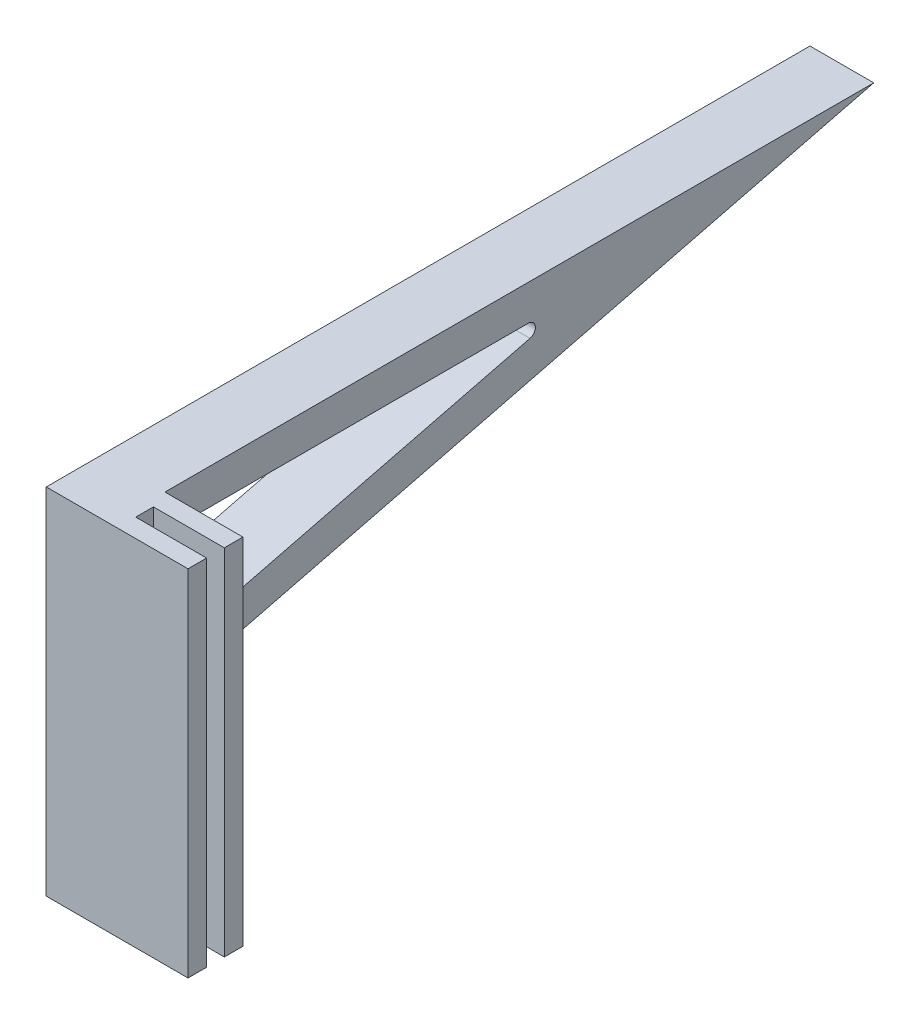
ISO-10303-21;
HEADER;
FILE_DESCRIPTION(('STEP AP214'),'2;1');
FILE_NAME('part.step','',(''),(''),'','','');
FILE_SCHEMA(('AUTOMOTIVE_DESIGN { 1 0 10303 214 1 1 1 1 }'));
ENDSEC;
DATA;
#1=APPLICATION_CONTEXT('core data for automotive mechanical design processes');
#2=APPLICATION_PROTOCOL_DEFINITION('international standard','automotive_design',2000,#1);
#3=PRODUCT_CONTEXT('',#1,'mechanical');
#4=PRODUCT('Part','Part','',(#3));
#5=PRODUCT_RELATED_PRODUCT_CATEGORY('part','',(#4));
#6=PRODUCT_DEFINITION_FORMATION('','',#4);
#7=PRODUCT_DEFINITION_CONTEXT('part definition',#1,'design');
#8=PRODUCT_DEFINITION('design','',#6,#7);
#9=PRODUCT_DEFINITION_SHAPE('','',#8);
#10=(LENGTH_UNIT() NAMED_UNIT(*) SI_UNIT(.MILLI.,.METRE.));
#11=(NAMED_UNIT(*) PLANE_ANGLE_UNIT() SI_UNIT($,.RADIAN.));
#12=(NAMED_UNIT(*) SI_UNIT($,.STERADIAN.) SOLID_ANGLE_UNIT());
#13=UNCERTAINTY_MEASURE_WITH_UNIT(LENGTH_MEASURE(1.E-05),#10,'distance_accuracy_value','');
#14=(GEOMETRIC_REPRESENTATION_CONTEXT(3) GLOBAL_UNCERTAINTY_ASSIGNED_CONTEXT((#13)) GLOBAL_UNIT_ASSIGNED_CONTEXT((#10,
#11,#12)) REPRESENTATION_CONTEXT('',''));
#15=CARTESIAN_POINT('',(0.,0.,0.));
#16=DIRECTION('',(0.,0.,1.));
#17=DIRECTION('',(1.,0.,0.));
#18=AXIS2_PLACEMENT_3D('',#15,#16,#17);
#19=CARTESIAN_POINT('',(20.,100.,-10.25));
#20=DIRECTION('',(0.,0.,1.));
#21=DIRECTION('',(1.,0.,0.));
#22=AXIS2_PLACEMENT_3D('',#19,#20,#21);
#23=PLANE('',#22);
#24=CARTESIAN_POINT('',(9.99999999999545,50.0000000000057,-10.25));
#25=DIRECTION('',(0.,0.,-1.));
#26=DIRECTION('',(-1.,0.,0.));
#27=AXIS2_PLACEMENT_3D('',#24,#25,#26);
#28=CIRCLE('',#27,2.5);
#29=CARTESIAN_POINT('',(7.49999999999545,50.0000000000057,-10.25));
#30=VERTEX_POINT('',#29);
#31=EDGE_CURVE('E324',#30,#30,#28,.T.);
#32=ORIENTED_EDGE('',*,*,#31,.F.);
#33=EDGE_LOOP('',(#32));
#34=FACE_BOUND('',#33,.T.);
#35=DIRECTION('',(0.,-1.,0.));
#36=VECTOR('',#35,1.);
#37=CARTESIAN_POINT('',(-20.,100.,-10.25));
#38=LINE('',#37,#36);
#39=CARTESIAN_POINT('',(-20.,87.,-10.25));
#40=VERTEX_POINT('',#39);
#41=CARTESIAN_POINT('',(-20.,62.869316876853,-10.25));
#42=VERTEX_POINT('',#41);
#43=EDGE_CURVE('E263',#40,#42,#38,.T.);
#44=ORIENTED_EDGE('',*,*,#43,.F.);
#45=DIRECTION('',(-1.,0.,0.));
#46=VECTOR('',#45,1.);
#47=CARTESIAN_POINT('',(-2.,87.,-10.25));
#48=LINE('',#47,#46);
#49=CARTESIAN_POINT('',(-2.00000000000001,87.,-10.25));
#50=VERTEX_POINT('',#49);
#51=EDGE_CURVE('E296',#40,#50,#48,.F.);
#52=ORIENTED_EDGE('',*,*,#51,.T.);
#53=DIRECTION('',(0.,-1.,0.));
#54=VECTOR('',#53,1.);
#55=CARTESIAN_POINT('',(-2.00000000000001,100.,-10.25));
#56=LINE('',#55,#54);
#57=CARTESIAN_POINT('',(-2.,100.,-10.25));
#58=VERTEX_POINT('',#57);
#59=EDGE_CURVE('E214',#58,#50,#56,.T.);
#60=ORIENTED_EDGE('',*,*,#59,.F.);
#61=DIRECTION('',(-1.,0.,0.));
#62=VECTOR('',#61,1.);
#63=CARTESIAN_POINT('',(20.,100.,-10.25));
#64=LINE('',#63,#62);
#65=CARTESIAN_POINT('',(20.,100.,-10.25));
#66=VERTEX_POINT('',#65);
#67=EDGE_CURVE('E191',#66,#58,#64,.T.);
#68=ORIENTED_EDGE('',*,*,#67,.F.);
#69=DIRECTION('',(0.,-1.,0.));
#70=VECTOR('',#69,1.);
#71=CARTESIAN_POINT('',(20.,100.,-10.25));
#72=LINE('',#71,#70);
#73=CARTESIAN_POINT('',(20.,0.,-10.25));
#74=VERTEX_POINT('',#73);
#75=EDGE_CURVE('E264',#66,#74,#72,.T.);
#76=ORIENTED_EDGE('',*,*,#75,.T.);
#77=DIRECTION('',(-1.,0.,0.));
#78=VECTOR('',#77,1.);
#79=CARTESIAN_POINT('',(20.,0.,-10.25));
#80=LINE('',#79,#78);
#81=CARTESIAN_POINT('',(-20.,0.,-10.25));
#82=VERTEX_POINT('',#81);
#83=EDGE_CURVE('E240',#74,#82,#80,.T.);
#84=ORIENTED_EDGE('',*,*,#83,.T.);
#85=CARTESIAN_POINT('',(-20.,47.6576707807868,-10.25));
#86=VERTEX_POINT('',#85);
#87=EDGE_CURVE('E261',#86,#82,#38,.T.);
#88=ORIENTED_EDGE('',*,*,#87,.F.);
#89=DIRECTION('',(-1.,0.,0.));
#90=VECTOR('',#89,1.);
#91=CARTESIAN_POINT('',(20.,47.6576707807868,-10.25));
#92=LINE('',#91,#90);
#93=CARTESIAN_POINT('',(-2.00000000000001,47.6576707807868,-10.25));
#94=VERTEX_POINT('',#93);
#95=EDGE_CURVE('E275',#86,#94,#92,.F.);
#96=ORIENTED_EDGE('',*,*,#95,.T.);
#97=CARTESIAN_POINT('',(-2.00000000000001,62.869316876853,-10.25));
#98=VERTEX_POINT('',#97);
#99=EDGE_CURVE('E203',#98,#94,#56,.T.);
#100=ORIENTED_EDGE('',*,*,#99,.F.);
#101=DIRECTION('',(1.,0.,0.));
#102=VECTOR('',#101,1.);
#103=CARTESIAN_POINT('',(-20.,62.869316876853,-10.25));
#104=LINE('',#103,#102);
#105=EDGE_CURVE('E284',#98,#42,#104,.F.);
#106=ORIENTED_EDGE('',*,*,#105,.T.);
#107=EDGE_LOOP('',(#44,#52,#60,#68,#76,#84,#88,#96,#100,#106));
#108=FACE_BOUND('',#107,.T.);
#109=ADVANCED_FACE('F65',(#34,#108),#23,.F.);
#110=CARTESIAN_POINT('',(0.,100.,0.));
#111=DIRECTION('',(-1.,0.,0.));
#112=DIRECTION('',(0.,0.,1.));
#113=AXIS2_PLACEMENT_3D('',#110,#111,#112);
#114=PLANE('',#113);
#115=DIRECTION('',(0.,0.,-1.));
#116=VECTOR('',#115,1.);
#117=CARTESIAN_POINT('',(0.,0.,0.));
#118=LINE('',#117,#116);
#119=CARTESIAN_POINT('',(0.,0.,0.));
#120=VERTEX_POINT('',#119);
#121=CARTESIAN_POINT('',(0.,0.,-5.));
#122=VERTEX_POINT('',#121);
#123=EDGE_CURVE('E233',#120,#122,#118,.T.);
#124=ORIENTED_EDGE('',*,*,#123,.T.);
#125=DIRECTION('',(0.,-1.,0.));
#126=VECTOR('',#125,1.);
#127=CARTESIAN_POINT('',(0.,100.,-5.));
#128=LINE('',#127,#126);
#129=CARTESIAN_POINT('',(0.,100.,-5.));
#130=VERTEX_POINT('',#129);
#131=EDGE_CURVE('E270',#130,#122,#128,.T.);
#132=ORIENTED_EDGE('',*,*,#131,.F.);
#133=DIRECTION('',(0.,0.,-1.));
#134=VECTOR('',#133,1.);
#135=CARTESIAN_POINT('',(0.,100.,0.));
#136=LINE('',#135,#134);
#137=CARTESIAN_POINT('',(0.,100.,0.));
#138=VERTEX_POINT('',#137);
#139=EDGE_CURVE('E215',#138,#130,#136,.T.);
#140=ORIENTED_EDGE('',*,*,#139,.F.);
#141=DIRECTION('',(0.,-1.,0.));
#142=VECTOR('',#141,1.);
#143=CARTESIAN_POINT('',(0.,100.,0.));
#144=LINE('',#143,#142);
#145=EDGE_CURVE('E232',#138,#120,#144,.T.);
#146=ORIENTED_EDGE('',*,*,#145,.T.);
#147=EDGE_LOOP('',(#124,#132,#140,#146));
#148=FACE_BOUND('',#147,.T.);
#149=ADVANCED_FACE('F336',(#148),#114,.F.);
#150=CARTESIAN_POINT('',(0.,100.,-5.));
#151=DIRECTION('',(0.,0.,-1.));
#152=DIRECTION('',(-1.,0.,0.));
#153=AXIS2_PLACEMENT_3D('',#150,#151,#152);
#154=PLANE('',#153);
#155=CARTESIAN_POINT('',(9.99999999999545,50.0000000000057,-5.));
#156=DIRECTION('',(0.,0.,-1.));
#157=DIRECTION('',(-1.,0.,0.));
#158=AXIS2_PLACEMENT_3D('',#155,#156,#157);
#159=CIRCLE('',#158,2.5);
#160=CARTESIAN_POINT('',(7.49999999999545,50.0000000000057,-5.));
#161=VERTEX_POINT('',#160);
#162=EDGE_CURVE('E320',#161,#161,#159,.F.);
#163=ORIENTED_EDGE('',*,*,#162,.F.);
#164=EDGE_LOOP('',(#163));
#165=FACE_BOUND('',#164,.T.);
#166=DIRECTION('',(1.,0.,0.));
#167=VECTOR('',#166,1.);
#168=CARTESIAN_POINT('',(0.,0.,-5.));
#169=LINE('',#168,#167);
#170=CARTESIAN_POINT('',(20.,0.,-5.));
#171=VERTEX_POINT('',#170);
#172=EDGE_CURVE('E236',#122,#171,#169,.T.);
#173=ORIENTED_EDGE('',*,*,#172,.T.);
#174=DIRECTION('',(0.,-1.,0.));
#175=VECTOR('',#174,1.);
#176=CARTESIAN_POINT('',(20.,100.,-5.));
#177=LINE('',#176,#175);
#178=CARTESIAN_POINT('',(20.,100.,-5.));
#179=VERTEX_POINT('',#178);
#180=EDGE_CURVE('E267',#179,#171,#177,.T.);
#181=ORIENTED_EDGE('',*,*,#180,.F.);
#182=DIRECTION('',(1.,0.,0.));
#183=VECTOR('',#182,1.);
#184=CARTESIAN_POINT('',(0.,100.,-5.));
#185=LINE('',#184,#183);
#186=EDGE_CURVE('E218',#130,#179,#185,.T.);
#187=ORIENTED_EDGE('',*,*,#186,.F.);
#188=ORIENTED_EDGE('',*,*,#131,.T.);
#189=EDGE_LOOP('',(#173,#181,#187,#188));
#190=FACE_BOUND('',#189,.T.);
#191=ADVANCED_FACE('F332',(#165,#190),#154,.F.);
#192=CARTESIAN_POINT('',(20.,100.,-5.));
#193=DIRECTION('',(-1.,0.,0.));
#194=DIRECTION('',(0.,0.,1.));
#195=AXIS2_PLACEMENT_3D('',#192,#193,#194);
#196=PLANE('',#195);
#197=DIRECTION('',(0.,0.,-1.));
#198=VECTOR('',#197,1.);
#199=CARTESIAN_POINT('',(20.,0.,-5.));
#200=LINE('',#199,#198);
#201=EDGE_CURVE('E238',#171,#74,#200,.T.);
#202=ORIENTED_EDGE('',*,*,#201,.T.);
#203=ORIENTED_EDGE('',*,*,#75,.F.);
#204=DIRECTION('',(0.,0.,-1.));
#205=VECTOR('',#204,1.);
#206=CARTESIAN_POINT('',(20.,100.,-5.));
#207=LINE('',#206,#205);
#208=EDGE_CURVE('E221',#179,#66,#207,.T.);
#209=ORIENTED_EDGE('',*,*,#208,.F.);
#210=ORIENTED_EDGE('',*,*,#180,.T.);
#211=EDGE_LOOP('',(#202,#203,#209,#210));
#212=FACE_BOUND('',#211,.T.);
#213=ADVANCED_FACE('F335',(#212),#196,.F.);
#214=CARTESIAN_POINT('',(-20.,100.,5.25000000000001));
#215=DIRECTION('',(1.,0.,0.));
#216=DIRECTION('',(0.,0.,-1.));
#217=AXIS2_PLACEMENT_3D('',#214,#215,#216);
#218=PLANE('',#217);
#219=DIRECTION('',(0.,0.,-1.));
#220=VECTOR('',#219,1.);
#221=CARTESIAN_POINT('',(-20.,90.,-10.25));
#222=LINE('',#221,#220);
#223=CARTESIAN_POINT('',(-20.,90.,-13.25));
#224=VERTEX_POINT('',#223);
#225=CARTESIAN_POINT('',(-20.,90.,-112.772732492588));
#226=VERTEX_POINT('',#225);
#227=EDGE_CURVE('E318',#224,#226,#222,.T.);
#228=ORIENTED_EDGE('',*,*,#227,.F.);
#229=CARTESIAN_POINT('',(-20.,87.,-13.25));
#230=DIRECTION('',(1.,0.,0.));
#231=DIRECTION('',(0.,0.,-1.));
#232=AXIS2_PLACEMENT_3D('',#229,#230,#231);
#233=CIRCLE('',#232,3.);
#234=EDGE_CURVE('E299',#224,#40,#233,.T.);
#235=ORIENTED_EDGE('',*,*,#234,.T.);
#236=ORIENTED_EDGE('',*,*,#43,.T.);
#237=CARTESIAN_POINT('',(-20.,62.869316876853,-12.25));
#238=DIRECTION('',(1.,0.,0.));
#239=DIRECTION('',(0.,0.,-1.));
#240=AXIS2_PLACEMENT_3D('',#237,#238,#239);
#241=CIRCLE('',#240,2.);
#242=CARTESIAN_POINT('',(-20.,60.9290318765623,-12.7350712500726));
#243=VERTEX_POINT('',#242);
#244=EDGE_CURVE('E290',#42,#243,#241,.T.);
#245=ORIENTED_EDGE('',*,*,#244,.T.);
#246=DIRECTION('',(0.,-0.242535625036333,0.970142500145332));
#247=VECTOR('',#246,1.);
#248=CARTESIAN_POINT('',(-20.,109.701425001453,-207.824643749637));
#249=LINE('',#248,#247);
#250=CARTESIAN_POINT('',(-20.,86.0597149997093,-113.257803742661));
#251=VERTEX_POINT('',#250);
#252=EDGE_CURVE('E310',#251,#243,#249,.T.);
#253=ORIENTED_EDGE('',*,*,#252,.F.);
#254=CARTESIAN_POINT('',(-20.,88.,-112.772732492588));
#255=DIRECTION('',(1.,0.,0.));
#256=DIRECTION('',(0.,0.,-1.));
#257=AXIS2_PLACEMENT_3D('',#254,#255,#256);
#258=CIRCLE('',#257,2.);
#259=EDGE_CURVE('E73',#251,#226,#258,.T.);
#260=ORIENTED_EDGE('',*,*,#259,.T.);
#261=EDGE_LOOP('',(#228,#235,#236,#245,#253,#260));
#262=FACE_BOUND('',#261,.T.);
#263=DIRECTION('',(0.,0.,1.));
#264=VECTOR('',#263,1.);
#265=CARTESIAN_POINT('',(-20.,100.,5.25000000000001));
#266=LINE('',#265,#264);
#267=CARTESIAN_POINT('',(-20.,100.,-210.25));
#268=VERTEX_POINT('',#267);
#269=CARTESIAN_POINT('',(-20.,100.,5.25000000000001));
#270=VERTEX_POINT('',#269);
#271=EDGE_CURVE('E224',#268,#270,#266,.T.);
#272=ORIENTED_EDGE('',*,*,#271,.F.);
#273=DIRECTION('',(0.,-0.242535625036333,0.970142500145332));
#274=VECTOR('',#273,1.);
#275=CARTESIAN_POINT('',(-20.,100.,-210.25));
#276=LINE('',#275,#274);
#277=CARTESIAN_POINT('',(-20.,50.5680982812228,-12.522393124891));
#278=VERTEX_POINT('',#277);
#279=EDGE_CURVE('E195',#268,#278,#276,.T.);
#280=ORIENTED_EDGE('',*,*,#279,.T.);
#281=CARTESIAN_POINT('',(-20.,47.6576707807868,-13.25));
#282=DIRECTION('',(1.,0.,0.));
#283=DIRECTION('',(0.,0.,-1.));
#284=AXIS2_PLACEMENT_3D('',#281,#282,#283);
#285=CIRCLE('',#284,3.);
#286=EDGE_CURVE('E278',#278,#86,#285,.T.);
#287=ORIENTED_EDGE('',*,*,#286,.T.);
#288=ORIENTED_EDGE('',*,*,#87,.T.);
#289=DIRECTION('',(0.,0.,1.));
#290=VECTOR('',#289,1.);
#291=CARTESIAN_POINT('',(-20.,0.,5.25000000000001));
#292=LINE('',#291,#290);
#293=CARTESIAN_POINT('',(-20.,0.,5.25000000000001));
#294=VERTEX_POINT('',#293);
#295=EDGE_CURVE('E243',#82,#294,#292,.T.);
#296=ORIENTED_EDGE('',*,*,#295,.T.);
#297=DIRECTION('',(0.,-1.,0.));
#298=VECTOR('',#297,1.);
#299=CARTESIAN_POINT('',(-20.,100.,5.25000000000001));
#300=LINE('',#299,#298);
#301=EDGE_CURVE('E258',#270,#294,#300,.T.);
#302=ORIENTED_EDGE('',*,*,#301,.F.);
#303=EDGE_LOOP('',(#272,#280,#287,#288,#296,#302));
#304=FACE_BOUND('',#303,.T.);
#305=ADVANCED_FACE('F313',(#262,#304),#218,.F.);
#306=CARTESIAN_POINT('',(20.,100.,5.25));
#307=DIRECTION('',(0.,0.,-1.));
#308=DIRECTION('',(-1.,0.,0.));
#309=AXIS2_PLACEMENT_3D('',#306,#307,#308);
#310=PLANE('',#309);
#311=DIRECTION('',(1.,0.,0.));
#312=VECTOR('',#311,1.);
#313=CARTESIAN_POINT('',(20.,0.,5.25));
#314=LINE('',#313,#312);
#315=CARTESIAN_POINT('',(20.,0.,5.25));
#316=VERTEX_POINT('',#315);
#317=EDGE_CURVE('E245',#294,#316,#314,.T.);
#318=ORIENTED_EDGE('',*,*,#317,.T.);
#319=DIRECTION('',(0.,-1.,0.));
#320=VECTOR('',#319,1.);
#321=CARTESIAN_POINT('',(20.,100.,5.25));
#322=LINE('',#321,#320);
#323=CARTESIAN_POINT('',(20.,100.,5.25));
#324=VERTEX_POINT('',#323);
#325=EDGE_CURVE('E255',#324,#316,#322,.T.);
#326=ORIENTED_EDGE('',*,*,#325,.F.);
#327=DIRECTION('',(1.,0.,0.));
#328=VECTOR('',#327,1.);
#329=CARTESIAN_POINT('',(20.,100.,5.25));
#330=LINE('',#329,#328);
#331=EDGE_CURVE('E226',#270,#324,#330,.T.);
#332=ORIENTED_EDGE('',*,*,#331,.F.);
#333=ORIENTED_EDGE('',*,*,#301,.T.);
#334=EDGE_LOOP('',(#318,#326,#332,#333));
#335=FACE_BOUND('',#334,.T.);
#336=ADVANCED_FACE('F409',(#335),#310,.F.);
#337=CARTESIAN_POINT('',(20.,100.,0.));
#338=DIRECTION('',(-1.,0.,0.));
#339=DIRECTION('',(0.,0.,1.));
#340=AXIS2_PLACEMENT_3D('',#337,#338,#339);
#341=PLANE('',#340);
#342=DIRECTION('',(0.,0.,-1.));
#343=VECTOR('',#342,1.);
#344=CARTESIAN_POINT('',(20.,0.,0.));
#345=LINE('',#344,#343);
#346=CARTESIAN_POINT('',(20.,0.,0.));
#347=VERTEX_POINT('',#346);
#348=EDGE_CURVE('E247',#316,#347,#345,.T.);
#349=ORIENTED_EDGE('',*,*,#348,.T.);
#350=DIRECTION('',(0.,-1.,0.));
#351=VECTOR('',#350,1.);
#352=CARTESIAN_POINT('',(20.,100.,0.));
#353=LINE('',#352,#351);
#354=CARTESIAN_POINT('',(20.,100.,0.));
#355=VERTEX_POINT('',#354);
#356=EDGE_CURVE('E252',#355,#347,#353,.T.);
#357=ORIENTED_EDGE('',*,*,#356,.F.);
#358=DIRECTION('',(0.,0.,-1.));
#359=VECTOR('',#358,1.);
#360=CARTESIAN_POINT('',(20.,100.,0.));
#361=LINE('',#360,#359);
#362=EDGE_CURVE('E228',#324,#355,#361,.T.);
#363=ORIENTED_EDGE('',*,*,#362,.F.);
#364=ORIENTED_EDGE('',*,*,#325,.T.);
#365=EDGE_LOOP('',(#349,#357,#363,#364));
#366=FACE_BOUND('',#365,.T.);
#367=ADVANCED_FACE('F474',(#366),#341,.F.);
#368=CARTESIAN_POINT('',(0.,100.,0.));
#369=DIRECTION('',(0.,0.,1.));
#370=DIRECTION('',(1.,0.,0.));
#371=AXIS2_PLACEMENT_3D('',#368,#369,#370);
#372=PLANE('',#371);
#373=DIRECTION('',(-1.,0.,0.));
#374=VECTOR('',#373,1.);
#375=CARTESIAN_POINT('',(0.,0.,0.));
#376=LINE('',#375,#374);
#377=EDGE_CURVE('E219',#347,#120,#376,.T.);
#378=ORIENTED_EDGE('',*,*,#377,.T.);
#379=ORIENTED_EDGE('',*,*,#145,.F.);
#380=DIRECTION('',(-1.,0.,0.));
#381=VECTOR('',#380,1.);
#382=CARTESIAN_POINT('',(0.,100.,0.));
#383=LINE('',#382,#381);
#384=EDGE_CURVE('E230',#355,#138,#383,.T.);
#385=ORIENTED_EDGE('',*,*,#384,.F.);
#386=ORIENTED_EDGE('',*,*,#356,.T.);
#387=EDGE_LOOP('',(#378,#379,#385,#386));
#388=FACE_BOUND('',#387,.T.);
#389=ADVANCED_FACE('F479',(#388),#372,.F.);
#390=CARTESIAN_POINT('',(0.,100.,0.));
#391=DIRECTION('',(0.,-1.,0.));
#392=DIRECTION('',(0.,0.,-1.));
#393=AXIS2_PLACEMENT_3D('',#390,#391,#392);
#394=PLANE('',#393);
#395=ORIENTED_EDGE('',*,*,#331,.T.);
#396=ORIENTED_EDGE('',*,*,#362,.T.);
#397=ORIENTED_EDGE('',*,*,#384,.T.);
#398=ORIENTED_EDGE('',*,*,#139,.T.);
#399=ORIENTED_EDGE('',*,*,#186,.T.);
#400=ORIENTED_EDGE('',*,*,#208,.T.);
#401=ORIENTED_EDGE('',*,*,#67,.T.);
#402=DIRECTION('',(0.,0.,-1.));
#403=VECTOR('',#402,1.);
#404=CARTESIAN_POINT('',(-2.,100.,5.25));
#405=LINE('',#404,#403);
#406=CARTESIAN_POINT('',(-2.00000000000005,100.,-210.25));
#407=VERTEX_POINT('',#406);
#408=EDGE_CURVE('E185',#58,#407,#405,.T.);
#409=ORIENTED_EDGE('',*,*,#408,.T.);
#410=DIRECTION('',(-1.,0.,0.));
#411=VECTOR('',#410,1.);
#412=CARTESIAN_POINT('',(-2.00000000000005,100.,-210.25));
#413=LINE('',#412,#411);
#414=EDGE_CURVE('E188',#407,#268,#413,.T.);
#415=ORIENTED_EDGE('',*,*,#414,.T.);
#416=ORIENTED_EDGE('',*,*,#271,.T.);
#417=EDGE_LOOP('',(#395,#396,#397,#398,#399,#400,#401,#409,#415,#416));
#418=FACE_BOUND('',#417,.T.);
#419=ADVANCED_FACE('F187',(#418),#394,.F.);
#420=CARTESIAN_POINT('',(0.,0.,0.));
#421=DIRECTION('',(0.,-1.,0.));
#422=DIRECTION('',(0.,0.,-1.));
#423=AXIS2_PLACEMENT_3D('',#420,#421,#422);
#424=PLANE('',#423);
#425=ORIENTED_EDGE('',*,*,#295,.F.);
#426=ORIENTED_EDGE('',*,*,#83,.F.);
#427=ORIENTED_EDGE('',*,*,#201,.F.);
#428=ORIENTED_EDGE('',*,*,#172,.F.);
#429=ORIENTED_EDGE('',*,*,#123,.F.);
#430=ORIENTED_EDGE('',*,*,#377,.F.);
#431=ORIENTED_EDGE('',*,*,#348,.F.);
#432=ORIENTED_EDGE('',*,*,#317,.F.);
#433=EDGE_LOOP('',(#425,#426,#427,#428,#429,#430,#431,#432));
#434=FACE_BOUND('',#433,.T.);
#435=ADVANCED_FACE('F348',(#434),#424,.T.);
#436=CARTESIAN_POINT('',(-2.00000000000005,109.701425001453,-207.824643749637));
#437=DIRECTION('',(0.,-0.970142500145332,-0.242535625036333));
#438=DIRECTION('',(0.,0.242535625036333,-0.970142500145332));
#439=AXIS2_PLACEMENT_3D('',#436,#437,#438);
#440=PLANE('',#439);
#441=DIRECTION('',(0.,-0.242535625036333,0.970142500145332));
#442=VECTOR('',#441,1.);
#443=CARTESIAN_POINT('',(-2.00000000000005,109.701425001453,-207.824643749637));
#444=LINE('',#443,#442);
#445=CARTESIAN_POINT('',(-2.00000000000003,86.0597149997093,-113.257803742661));
#446=VERTEX_POINT('',#445);
#447=CARTESIAN_POINT('',(-2.00000000000001,60.9290318765623,-12.7350712500726));
#448=VERTEX_POINT('',#447);
#449=EDGE_CURVE('E211',#446,#448,#444,.T.);
#450=ORIENTED_EDGE('',*,*,#449,.F.);
#451=DIRECTION('',(-1.,0.,0.));
#452=VECTOR('',#451,1.);
#453=CARTESIAN_POINT('',(-20.,86.0597149997093,-113.257803742661));
#454=LINE('',#453,#452);
#455=EDGE_CURVE('E303',#446,#251,#454,.T.);
#456=ORIENTED_EDGE('',*,*,#455,.T.);
#457=ORIENTED_EDGE('',*,*,#252,.T.);
#458=DIRECTION('',(1.,0.,0.));
#459=VECTOR('',#458,1.);
#460=CARTESIAN_POINT('',(-2.00000000000001,60.9290318765623,-12.7350712500727));
#461=LINE('',#460,#459);
#462=EDGE_CURVE('E281',#243,#448,#461,.T.);
#463=ORIENTED_EDGE('',*,*,#462,.T.);
#464=EDGE_LOOP('',(#450,#456,#457,#463));
#465=FACE_BOUND('',#464,.T.);
#466=ADVANCED_FACE('F309',(#465),#440,.F.);
#467=CARTESIAN_POINT('',(-2.00000000000001,90.,-10.25));
#468=DIRECTION('',(0.,1.,0.));
#469=DIRECTION('',(0.,0.,1.));
#470=AXIS2_PLACEMENT_3D('',#467,#468,#469);
#471=PLANE('',#470);
#472=ORIENTED_EDGE('',*,*,#227,.T.);
#473=DIRECTION('',(-1.,0.,0.));
#474=VECTOR('',#473,1.);
#475=CARTESIAN_POINT('',(-2.00000000000003,90.,-112.772732492588));
#476=LINE('',#475,#474);
#477=CARTESIAN_POINT('',(-2.00000000000003,90.,-112.772732492588));
#478=VERTEX_POINT('',#477);
#479=EDGE_CURVE('E86',#226,#478,#476,.F.);
#480=ORIENTED_EDGE('',*,*,#479,.T.);
#481=DIRECTION('',(0.,0.,-1.));
#482=VECTOR('',#481,1.);
#483=CARTESIAN_POINT('',(-2.,90.,5.25));
#484=LINE('',#483,#482);
#485=CARTESIAN_POINT('',(-2.00000000000001,90.,-13.25));
#486=VERTEX_POINT('',#485);
#487=EDGE_CURVE('E317',#486,#478,#484,.T.);
#488=ORIENTED_EDGE('',*,*,#487,.F.);
#489=DIRECTION('',(-1.,0.,0.));
#490=VECTOR('',#489,1.);
#491=CARTESIAN_POINT('',(-20.,90.,-13.25));
#492=LINE('',#491,#490);
#493=EDGE_CURVE('E293',#486,#224,#492,.T.);
#494=ORIENTED_EDGE('',*,*,#493,.T.);
#495=EDGE_LOOP('',(#472,#480,#488,#494));
#496=FACE_BOUND('',#495,.T.);
#497=ADVANCED_FACE('F358',(#496),#471,.F.);
#498=CARTESIAN_POINT('',(-2.,0.,0.));
#499=DIRECTION('',(-1.,0.,0.));
#500=DIRECTION('',(0.,0.,1.));
#501=AXIS2_PLACEMENT_3D('',#498,#499,#500);
#502=PLANE('',#501);
#503=ORIENTED_EDGE('',*,*,#408,.F.);
#504=ORIENTED_EDGE('',*,*,#59,.T.);
#505=CARTESIAN_POINT('',(-2.,87.,-13.25));
#506=DIRECTION('',(-1.,0.,0.));
#507=DIRECTION('',(0.,0.,1.));
#508=AXIS2_PLACEMENT_3D('',#505,#506,#507);
#509=CIRCLE('',#508,3.);
#510=EDGE_CURVE('E301',#50,#486,#509,.T.);
#511=ORIENTED_EDGE('',*,*,#510,.T.);
#512=ORIENTED_EDGE('',*,*,#487,.T.);
#513=CARTESIAN_POINT('',(-2.00000000000003,88.,-112.772732492588));
#514=DIRECTION('',(-1.,0.,0.));
#515=DIRECTION('',(0.,0.,1.));
#516=AXIS2_PLACEMENT_3D('',#513,#514,#515);
#517=CIRCLE('',#516,2.);
#518=EDGE_CURVE('E12',#478,#446,#517,.T.);
#519=ORIENTED_EDGE('',*,*,#518,.T.);
#520=ORIENTED_EDGE('',*,*,#449,.T.);
#521=CARTESIAN_POINT('',(-2.,62.869316876853,-12.25));
#522=DIRECTION('',(-1.,0.,0.));
#523=DIRECTION('',(0.,0.,1.));
#524=AXIS2_PLACEMENT_3D('',#521,#522,#523);
#525=CIRCLE('',#524,2.);
#526=EDGE_CURVE('E287',#448,#98,#525,.T.);
#527=ORIENTED_EDGE('',*,*,#526,.T.);
#528=ORIENTED_EDGE('',*,*,#99,.T.);
#529=CARTESIAN_POINT('',(-2.,47.6576707807868,-13.25));
#530=DIRECTION('',(-1.,0.,0.));
#531=DIRECTION('',(0.,0.,1.));
#532=AXIS2_PLACEMENT_3D('',#529,#530,#531);
#533=CIRCLE('',#532,3.);
#534=CARTESIAN_POINT('',(-2.00000000000001,50.5680982812228,-12.522393124891));
#535=VERTEX_POINT('',#534);
#536=EDGE_CURVE('E207',#94,#535,#533,.T.);
#537=ORIENTED_EDGE('',*,*,#536,.T.);
#538=DIRECTION('',(0.,-0.242535625036333,0.970142500145332));
#539=VECTOR('',#538,1.);
#540=CARTESIAN_POINT('',(-2.00000000000005,100.,-210.25));
#541=LINE('',#540,#539);
#542=EDGE_CURVE('E194',#407,#535,#541,.T.);
#543=ORIENTED_EDGE('',*,*,#542,.F.);
#544=EDGE_LOOP('',(#503,#504,#511,#512,#519,#520,#527,#528,#537,#543));
#545=FACE_BOUND('',#544,.T.);
#546=ADVANCED_FACE('F205',(#545),#502,.F.);
#547=CARTESIAN_POINT('',(-2.00000000000005,100.,-210.25));
#548=DIRECTION('',(0.,-0.970142500145332,-0.242535625036333));
#549=DIRECTION('',(0.,0.242535625036333,-0.970142500145332));
#550=AXIS2_PLACEMENT_3D('',#547,#548,#549);
#551=PLANE('',#550);
#552=ORIENTED_EDGE('',*,*,#542,.T.);
#553=DIRECTION('',(-1.,0.,0.));
#554=VECTOR('',#553,1.);
#555=CARTESIAN_POINT('',(-2.00000000000003,50.5680982812228,-12.522393124891));
#556=LINE('',#555,#554);
#557=EDGE_CURVE('E273',#535,#278,#556,.T.);
#558=ORIENTED_EDGE('',*,*,#557,.T.);
#559=ORIENTED_EDGE('',*,*,#279,.F.);
#560=ORIENTED_EDGE('',*,*,#414,.F.);
#561=EDGE_LOOP('',(#552,#558,#559,#560));
#562=FACE_BOUND('',#561,.T.);
#563=ADVANCED_FACE('F199',(#562),#551,.T.);
#564=CARTESIAN_POINT('',(-2.00000000000003,47.6576707807868,-13.25));
#565=DIRECTION('',(-1.,0.,0.));
#566=DIRECTION('',(0.,0.,1.));
#567=AXIS2_PLACEMENT_3D('',#564,#565,#566);
#568=CYLINDRICAL_SURFACE('',#567,3.);
#569=ORIENTED_EDGE('',*,*,#536,.F.);
#570=ORIENTED_EDGE('',*,*,#95,.F.);
#571=ORIENTED_EDGE('',*,*,#286,.F.);
#572=ORIENTED_EDGE('',*,*,#557,.F.);
#573=EDGE_LOOP('',(#569,#570,#571,#572));
#574=FACE_BOUND('',#573,.T.);
#575=ADVANCED_FACE('F385',(#574),#568,.F.);
#576=CARTESIAN_POINT('',(-2.00000000000003,62.869316876853,-12.25));
#577=DIRECTION('',(-1.,0.,0.));
#578=DIRECTION('',(0.,0.,1.));
#579=AXIS2_PLACEMENT_3D('',#576,#577,#578);
#580=CYLINDRICAL_SURFACE('',#579,2.);
#581=ORIENTED_EDGE('',*,*,#244,.F.);
#582=ORIENTED_EDGE('',*,*,#105,.F.);
#583=ORIENTED_EDGE('',*,*,#526,.F.);
#584=ORIENTED_EDGE('',*,*,#462,.F.);
#585=EDGE_LOOP('',(#581,#582,#583,#584));
#586=FACE_BOUND('',#585,.T.);
#587=ADVANCED_FACE('F363',(#586),#580,.F.);
#588=CARTESIAN_POINT('',(-2.00000000000001,87.,-13.25));
#589=DIRECTION('',(1.,0.,0.));
#590=DIRECTION('',(0.,0.,-1.));
#591=AXIS2_PLACEMENT_3D('',#588,#589,#590);
#592=CYLINDRICAL_SURFACE('',#591,3.);
#593=ORIENTED_EDGE('',*,*,#510,.F.);
#594=ORIENTED_EDGE('',*,*,#51,.F.);
#595=ORIENTED_EDGE('',*,*,#234,.F.);
#596=ORIENTED_EDGE('',*,*,#493,.F.);
#597=EDGE_LOOP('',(#593,#594,#595,#596));
#598=FACE_BOUND('',#597,.T.);
#599=ADVANCED_FACE('F359',(#598),#592,.F.);
#600=CARTESIAN_POINT('',(-2.00000000000003,88.,-112.772732492588));
#601=DIRECTION('',(1.,0.,0.));
#602=DIRECTION('',(0.,0.,-1.));
#603=AXIS2_PLACEMENT_3D('',#600,#601,#602);
#604=CYLINDRICAL_SURFACE('',#603,2.);
#605=ORIENTED_EDGE('',*,*,#518,.F.);
#606=ORIENTED_EDGE('',*,*,#479,.F.);
#607=ORIENTED_EDGE('',*,*,#259,.F.);
#608=ORIENTED_EDGE('',*,*,#455,.F.);
#609=EDGE_LOOP('',(#605,#606,#607,#608));
#610=FACE_BOUND('',#609,.T.);
#611=ADVANCED_FACE('F67',(#610),#604,.F.);
#612=CARTESIAN_POINT('',(9.99999999999545,50.0000000000057,5.25100000000001));
#613=DIRECTION('',(0.,0.,-1.));
#614=DIRECTION('',(-1.,0.,0.));
#615=AXIS2_PLACEMENT_3D('',#612,#613,#614);
#616=CYLINDRICAL_SURFACE('',#615,2.5);
#617=ORIENTED_EDGE('',*,*,#31,.T.);
#618=EDGE_LOOP('',(#617));
#619=FACE_BOUND('',#618,.T.);
#620=ORIENTED_EDGE('',*,*,#162,.T.);
#621=EDGE_LOOP('',(#620));
#622=FACE_BOUND('',#621,.T.);
#623=ADVANCED_FACE('F330',(#619,#622),#616,.F.);
#624=CLOSED_SHELL('',(#109,#149,#191,#213,#305,#336,#367,#389,#419,#435,#466,#497,#546,#563,
#575,#587,#599,#611,#623));
#625=MANIFOLD_SOLID_BREP('B2',#624);
#626=ADVANCED_BREP_SHAPE_REPRESENTATION('',(#18,#625),#14);
#627=SHAPE_DEFINITION_REPRESENTATION(#9,#626);
ENDSEC;
END-ISO-10303-21;
